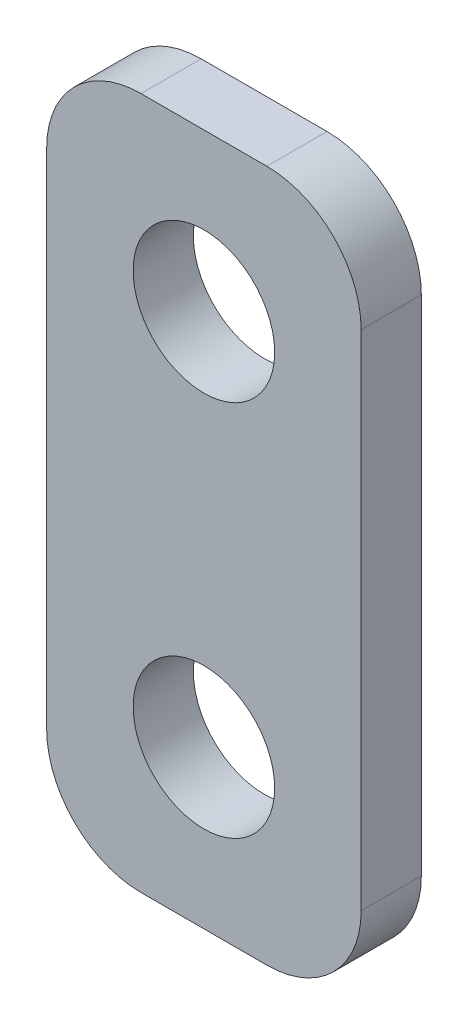
ISO-10303-21;
HEADER;
FILE_DESCRIPTION(('STEP AP214'),'2;1');
FILE_NAME('part.step','',(''),(''),'','','');
FILE_SCHEMA(('AUTOMOTIVE_DESIGN { 1 0 10303 214 1 1 1 1 }'));
ENDSEC;
DATA;
#1=APPLICATION_CONTEXT('core data for automotive mechanical design processes');
#2=APPLICATION_PROTOCOL_DEFINITION('international standard','automotive_design',2000,#1);
#3=PRODUCT_CONTEXT('',#1,'mechanical');
#4=PRODUCT('Part','Part','',(#3));
#5=PRODUCT_RELATED_PRODUCT_CATEGORY('part','',(#4));
#6=PRODUCT_DEFINITION_FORMATION('','',#4);
#7=PRODUCT_DEFINITION_CONTEXT('part definition',#1,'design');
#8=PRODUCT_DEFINITION('design','',#6,#7);
#9=PRODUCT_DEFINITION_SHAPE('','',#8);
#10=(LENGTH_UNIT() NAMED_UNIT(*) SI_UNIT(.MILLI.,.METRE.));
#11=(NAMED_UNIT(*) PLANE_ANGLE_UNIT() SI_UNIT($,.RADIAN.));
#12=(NAMED_UNIT(*) SI_UNIT($,.STERADIAN.) SOLID_ANGLE_UNIT());
#13=UNCERTAINTY_MEASURE_WITH_UNIT(LENGTH_MEASURE(1.E-05),#10,'distance_accuracy_value','');
#14=(GEOMETRIC_REPRESENTATION_CONTEXT(3) GLOBAL_UNCERTAINTY_ASSIGNED_CONTEXT((#13)) GLOBAL_UNIT_ASSIGNED_CONTEXT((#10,
#11,#12)) REPRESENTATION_CONTEXT('',''));
#15=CARTESIAN_POINT('',(0.,0.,0.));
#16=DIRECTION('',(0.,0.,1.));
#17=DIRECTION('',(1.,0.,0.));
#18=AXIS2_PLACEMENT_3D('',#15,#16,#17);
#19=CARTESIAN_POINT('',(-7.9375,17.4625,3.03784));
#20=DIRECTION('',(1.,0.,0.));
#21=DIRECTION('',(0.,1.,0.));
#22=AXIS2_PLACEMENT_3D('',#19,#20,#21);
#23=PLANE('',#22);
#24=DIRECTION('',(0.,-1.,0.));
#25=VECTOR('',#24,1.);
#26=CARTESIAN_POINT('',(-7.9375,17.4625,0.));
#27=LINE('',#26,#25);
#28=CARTESIAN_POINT('',(-7.9375,12.7,0.));
#29=VERTEX_POINT('',#28);
#30=CARTESIAN_POINT('',(-7.9375,-12.7,0.));
#31=VERTEX_POINT('',#30);
#32=EDGE_CURVE('E127',#29,#31,#27,.T.);
#33=ORIENTED_EDGE('',*,*,#32,.T.);
#34=DIRECTION('',(0.,0.,-1.));
#35=VECTOR('',#34,1.);
#36=CARTESIAN_POINT('',(-7.9375,-12.7,3.03784));
#37=LINE('',#36,#35);
#38=CARTESIAN_POINT('',(-7.9375,-12.7,3.03784));
#39=VERTEX_POINT('',#38);
#40=EDGE_CURVE('E105',#31,#39,#37,.F.);
#41=ORIENTED_EDGE('',*,*,#40,.T.);
#42=DIRECTION('',(0.,-1.,0.));
#43=VECTOR('',#42,1.);
#44=CARTESIAN_POINT('',(-7.9375,17.4625,3.03784));
#45=LINE('',#44,#43);
#46=CARTESIAN_POINT('',(-7.9375,12.7,3.03784));
#47=VERTEX_POINT('',#46);
#48=EDGE_CURVE('E137',#47,#39,#45,.T.);
#49=ORIENTED_EDGE('',*,*,#48,.F.);
#50=DIRECTION('',(0.,0.,-1.));
#51=VECTOR('',#50,1.);
#52=CARTESIAN_POINT('',(-7.9375,12.7,3.03784));
#53=LINE('',#52,#51);
#54=EDGE_CURVE('E110',#47,#29,#53,.T.);
#55=ORIENTED_EDGE('',*,*,#54,.T.);
#56=EDGE_LOOP('',(#33,#41,#49,#55));
#57=FACE_BOUND('',#56,.T.);
#58=ADVANCED_FACE('F34',(#57),#23,.F.);
#59=CARTESIAN_POINT('',(7.9375,-17.4625,3.03784));
#60=DIRECTION('',(0.,1.,0.));
#61=DIRECTION('',(0.,0.,1.));
#62=AXIS2_PLACEMENT_3D('',#59,#60,#61);
#63=PLANE('',#62);
#64=DIRECTION('',(1.,0.,0.));
#65=VECTOR('',#64,1.);
#66=CARTESIAN_POINT('',(7.9375,-17.4625,3.03784));
#67=LINE('',#66,#65);
#68=CARTESIAN_POINT('',(-3.175,-17.4625,3.03784));
#69=VERTEX_POINT('',#68);
#70=CARTESIAN_POINT('',(3.175,-17.4625,3.03784));
#71=VERTEX_POINT('',#70);
#72=EDGE_CURVE('E120',#69,#71,#67,.T.);
#73=ORIENTED_EDGE('',*,*,#72,.F.);
#74=DIRECTION('',(0.,0.,-1.));
#75=VECTOR('',#74,1.);
#76=CARTESIAN_POINT('',(-3.175,-17.4625,3.03784));
#77=LINE('',#76,#75);
#78=CARTESIAN_POINT('',(-3.175,-17.4625,0.));
#79=VERTEX_POINT('',#78);
#80=EDGE_CURVE('E104',#69,#79,#77,.T.);
#81=ORIENTED_EDGE('',*,*,#80,.T.);
#82=DIRECTION('',(1.,0.,0.));
#83=VECTOR('',#82,1.);
#84=CARTESIAN_POINT('',(7.9375,-17.4625,0.));
#85=LINE('',#84,#83);
#86=CARTESIAN_POINT('',(3.175,-17.4625,0.));
#87=VERTEX_POINT('',#86);
#88=EDGE_CURVE('E117',#79,#87,#85,.T.);
#89=ORIENTED_EDGE('',*,*,#88,.T.);
#90=DIRECTION('',(0.,0.,-1.));
#91=VECTOR('',#90,1.);
#92=CARTESIAN_POINT('',(3.175,-17.4625,3.03784));
#93=LINE('',#92,#91);
#94=EDGE_CURVE('E122',#87,#71,#93,.F.);
#95=ORIENTED_EDGE('',*,*,#94,.T.);
#96=EDGE_LOOP('',(#73,#81,#89,#95));
#97=FACE_BOUND('',#96,.T.);
#98=ADVANCED_FACE('F116',(#97),#63,.F.);
#99=CARTESIAN_POINT('',(7.9375,17.4625,3.03784));
#100=DIRECTION('',(-1.,0.,0.));
#101=DIRECTION('',(0.,-1.,0.));
#102=AXIS2_PLACEMENT_3D('',#99,#100,#101);
#103=PLANE('',#102);
#104=DIRECTION('',(0.,1.,0.));
#105=VECTOR('',#104,1.);
#106=CARTESIAN_POINT('',(7.9375,17.4625,3.03784));
#107=LINE('',#106,#105);
#108=CARTESIAN_POINT('',(7.9375,-12.7,3.03784));
#109=VERTEX_POINT('',#108);
#110=CARTESIAN_POINT('',(7.9375,12.7,3.03784));
#111=VERTEX_POINT('',#110);
#112=EDGE_CURVE('E163',#109,#111,#107,.T.);
#113=ORIENTED_EDGE('',*,*,#112,.F.);
#114=DIRECTION('',(0.,0.,-1.));
#115=VECTOR('',#114,1.);
#116=CARTESIAN_POINT('',(7.9375,-12.7,3.03784));
#117=LINE('',#116,#115);
#118=CARTESIAN_POINT('',(7.9375,-12.7,0.));
#119=VERTEX_POINT('',#118);
#120=EDGE_CURVE('E156',#109,#119,#117,.T.);
#121=ORIENTED_EDGE('',*,*,#120,.T.);
#122=DIRECTION('',(0.,1.,0.));
#123=VECTOR('',#122,1.);
#124=CARTESIAN_POINT('',(7.9375,17.4625,0.));
#125=LINE('',#124,#123);
#126=CARTESIAN_POINT('',(7.9375,12.7,0.));
#127=VERTEX_POINT('',#126);
#128=EDGE_CURVE('E126',#119,#127,#125,.T.);
#129=ORIENTED_EDGE('',*,*,#128,.T.);
#130=DIRECTION('',(0.,0.,-1.));
#131=VECTOR('',#130,1.);
#132=CARTESIAN_POINT('',(7.9375,12.7,3.03784));
#133=LINE('',#132,#131);
#134=EDGE_CURVE('E154',#127,#111,#133,.F.);
#135=ORIENTED_EDGE('',*,*,#134,.T.);
#136=EDGE_LOOP('',(#113,#121,#129,#135));
#137=FACE_BOUND('',#136,.T.);
#138=ADVANCED_FACE('F161',(#137),#103,.F.);
#139=CARTESIAN_POINT('',(7.9375,17.4625,3.03784));
#140=DIRECTION('',(0.,-1.,0.));
#141=DIRECTION('',(1.,0.,0.));
#142=AXIS2_PLACEMENT_3D('',#139,#140,#141);
#143=PLANE('',#142);
#144=DIRECTION('',(-1.,0.,0.));
#145=VECTOR('',#144,1.);
#146=CARTESIAN_POINT('',(7.9375,17.4625,3.03784));
#147=LINE('',#146,#145);
#148=CARTESIAN_POINT('',(3.175,17.4625,3.03784));
#149=VERTEX_POINT('',#148);
#150=CARTESIAN_POINT('',(-3.175,17.4625,3.03784));
#151=VERTEX_POINT('',#150);
#152=EDGE_CURVE('E138',#149,#151,#147,.T.);
#153=ORIENTED_EDGE('',*,*,#152,.F.);
#154=DIRECTION('',(0.,0.,-1.));
#155=VECTOR('',#154,1.);
#156=CARTESIAN_POINT('',(3.175,17.4625,3.03784));
#157=LINE('',#156,#155);
#158=CARTESIAN_POINT('',(3.175,17.4625,0.));
#159=VERTEX_POINT('',#158);
#160=EDGE_CURVE('E11',#149,#159,#157,.T.);
#161=ORIENTED_EDGE('',*,*,#160,.T.);
#162=DIRECTION('',(-1.,0.,0.));
#163=VECTOR('',#162,1.);
#164=CARTESIAN_POINT('',(7.9375,17.4625,0.));
#165=LINE('',#164,#163);
#166=CARTESIAN_POINT('',(-3.175,17.4625,0.));
#167=VERTEX_POINT('',#166);
#168=EDGE_CURVE('E130',#159,#167,#165,.T.);
#169=ORIENTED_EDGE('',*,*,#168,.T.);
#170=DIRECTION('',(0.,0.,-1.));
#171=VECTOR('',#170,1.);
#172=CARTESIAN_POINT('',(-3.175,17.4625,3.03784));
#173=LINE('',#172,#171);
#174=EDGE_CURVE('E42',#167,#151,#173,.F.);
#175=ORIENTED_EDGE('',*,*,#174,.T.);
#176=EDGE_LOOP('',(#153,#161,#169,#175));
#177=FACE_BOUND('',#176,.T.);
#178=ADVANCED_FACE('F170',(#177),#143,.F.);
#179=CARTESIAN_POINT('',(-7.9375,-17.4625,3.03784));
#180=DIRECTION('',(0.,0.,-1.));
#181=DIRECTION('',(-1.,0.,0.));
#182=AXIS2_PLACEMENT_3D('',#179,#180,#181);
#183=PLANE('',#182);
#184=CARTESIAN_POINT('',(0.,9.525,3.03784));
#185=DIRECTION('',(0.,0.,1.));
#186=DIRECTION('',(1.,0.,0.));
#187=AXIS2_PLACEMENT_3D('',#184,#185,#186);
#188=CIRCLE('',#187,3.57187499999999);
#189=CARTESIAN_POINT('',(3.57187499999999,9.525,3.03784));
#190=VERTEX_POINT('',#189);
#191=EDGE_CURVE('E185',#190,#190,#188,.T.);
#192=ORIENTED_EDGE('',*,*,#191,.F.);
#193=EDGE_LOOP('',(#192));
#194=FACE_BOUND('',#193,.T.);
#195=CARTESIAN_POINT('',(0.,-9.525,3.03784));
#196=DIRECTION('',(0.,0.,1.));
#197=DIRECTION('',(1.,0.,0.));
#198=AXIS2_PLACEMENT_3D('',#195,#196,#197);
#199=CIRCLE('',#198,3.57187499999999);
#200=CARTESIAN_POINT('',(3.57187499999999,-9.525,3.03784));
#201=VERTEX_POINT('',#200);
#202=EDGE_CURVE('E179',#201,#201,#199,.T.);
#203=ORIENTED_EDGE('',*,*,#202,.F.);
#204=EDGE_LOOP('',(#203));
#205=FACE_BOUND('',#204,.T.);
#206=ORIENTED_EDGE('',*,*,#48,.T.);
#207=CARTESIAN_POINT('',(-3.175,-12.7,3.03784));
#208=DIRECTION('',(0.,0.,-1.));
#209=DIRECTION('',(-1.,0.,0.));
#210=AXIS2_PLACEMENT_3D('',#207,#208,#209);
#211=CIRCLE('',#210,4.7625);
#212=EDGE_CURVE('E152',#39,#69,#211,.F.);
#213=ORIENTED_EDGE('',*,*,#212,.T.);
#214=ORIENTED_EDGE('',*,*,#72,.T.);
#215=CARTESIAN_POINT('',(3.175,-12.7,3.03784));
#216=DIRECTION('',(0.,0.,-1.));
#217=DIRECTION('',(-1.,0.,0.));
#218=AXIS2_PLACEMENT_3D('',#215,#216,#217);
#219=CIRCLE('',#218,4.7625);
#220=EDGE_CURVE('E150',#71,#109,#219,.F.);
#221=ORIENTED_EDGE('',*,*,#220,.T.);
#222=ORIENTED_EDGE('',*,*,#112,.T.);
#223=CARTESIAN_POINT('',(3.175,12.7,3.03784));
#224=DIRECTION('',(0.,0.,-1.));
#225=DIRECTION('',(-1.,0.,0.));
#226=AXIS2_PLACEMENT_3D('',#223,#224,#225);
#227=CIRCLE('',#226,4.7625);
#228=EDGE_CURVE('E55',#111,#149,#227,.F.);
#229=ORIENTED_EDGE('',*,*,#228,.T.);
#230=ORIENTED_EDGE('',*,*,#152,.T.);
#231=CARTESIAN_POINT('',(-3.175,12.7,3.03784));
#232=DIRECTION('',(0.,0.,-1.));
#233=DIRECTION('',(-1.,0.,0.));
#234=AXIS2_PLACEMENT_3D('',#231,#232,#233);
#235=CIRCLE('',#234,4.7625);
#236=EDGE_CURVE('E147',#151,#47,#235,.F.);
#237=ORIENTED_EDGE('',*,*,#236,.T.);
#238=EDGE_LOOP('',(#206,#213,#214,#221,#222,#229,#230,#237));
#239=FACE_BOUND('',#238,.T.);
#240=ADVANCED_FACE('F192',(#194,#205,#239),#183,.F.);
#241=CARTESIAN_POINT('',(-7.9375,-17.4625,0.));
#242=DIRECTION('',(0.,0.,-1.));
#243=DIRECTION('',(-1.,0.,0.));
#244=AXIS2_PLACEMENT_3D('',#241,#242,#243);
#245=PLANE('',#244);
#246=CARTESIAN_POINT('',(0.,9.525,0.));
#247=DIRECTION('',(0.,0.,-1.));
#248=DIRECTION('',(-1.,0.,0.));
#249=AXIS2_PLACEMENT_3D('',#246,#247,#248);
#250=CIRCLE('',#249,3.57187499999999);
#251=CARTESIAN_POINT('',(-3.57187499999999,9.525,0.));
#252=VERTEX_POINT('',#251);
#253=EDGE_CURVE('E182',#252,#252,#250,.T.);
#254=ORIENTED_EDGE('',*,*,#253,.F.);
#255=EDGE_LOOP('',(#254));
#256=FACE_BOUND('',#255,.T.);
#257=CARTESIAN_POINT('',(0.,-9.525,0.));
#258=DIRECTION('',(0.,0.,-1.));
#259=DIRECTION('',(-1.,0.,0.));
#260=AXIS2_PLACEMENT_3D('',#257,#258,#259);
#261=CIRCLE('',#260,3.57187499999999);
#262=CARTESIAN_POINT('',(-3.57187499999999,-9.525,0.));
#263=VERTEX_POINT('',#262);
#264=EDGE_CURVE('E132',#263,#263,#261,.T.);
#265=ORIENTED_EDGE('',*,*,#264,.F.);
#266=EDGE_LOOP('',(#265));
#267=FACE_BOUND('',#266,.T.);
#268=ORIENTED_EDGE('',*,*,#88,.F.);
#269=CARTESIAN_POINT('',(-3.175,-12.7,0.));
#270=DIRECTION('',(0.,0.,-1.));
#271=DIRECTION('',(-1.,0.,0.));
#272=AXIS2_PLACEMENT_3D('',#269,#270,#271);
#273=CIRCLE('',#272,4.7625);
#274=EDGE_CURVE('E100',#79,#31,#273,.T.);
#275=ORIENTED_EDGE('',*,*,#274,.T.);
#276=ORIENTED_EDGE('',*,*,#32,.F.);
#277=CARTESIAN_POINT('',(-3.175,12.7,0.));
#278=DIRECTION('',(0.,0.,-1.));
#279=DIRECTION('',(-1.,0.,0.));
#280=AXIS2_PLACEMENT_3D('',#277,#278,#279);
#281=CIRCLE('',#280,4.7625);
#282=EDGE_CURVE('E121',#29,#167,#281,.T.);
#283=ORIENTED_EDGE('',*,*,#282,.T.);
#284=ORIENTED_EDGE('',*,*,#168,.F.);
#285=CARTESIAN_POINT('',(3.175,12.7,0.));
#286=DIRECTION('',(0.,0.,-1.));
#287=DIRECTION('',(-1.,0.,0.));
#288=AXIS2_PLACEMENT_3D('',#285,#286,#287);
#289=CIRCLE('',#288,4.7625);
#290=EDGE_CURVE('E141',#159,#127,#289,.T.);
#291=ORIENTED_EDGE('',*,*,#290,.T.);
#292=ORIENTED_EDGE('',*,*,#128,.F.);
#293=CARTESIAN_POINT('',(3.175,-12.7,0.));
#294=DIRECTION('',(0.,0.,-1.));
#295=DIRECTION('',(-1.,0.,0.));
#296=AXIS2_PLACEMENT_3D('',#293,#294,#295);
#297=CIRCLE('',#296,4.7625);
#298=EDGE_CURVE('E111',#119,#87,#297,.T.);
#299=ORIENTED_EDGE('',*,*,#298,.T.);
#300=EDGE_LOOP('',(#268,#275,#276,#283,#284,#291,#292,#299));
#301=FACE_BOUND('',#300,.T.);
#302=ADVANCED_FACE('F124',(#256,#267,#301),#245,.T.);
#303=CARTESIAN_POINT('',(0.,-9.525,3.03784));
#304=DIRECTION('',(0.,0.,1.));
#305=DIRECTION('',(1.,0.,0.));
#306=AXIS2_PLACEMENT_3D('',#303,#304,#305);
#307=CYLINDRICAL_SURFACE('',#306,3.57187499999999);
#308=ORIENTED_EDGE('',*,*,#202,.T.);
#309=EDGE_LOOP('',(#308));
#310=FACE_BOUND('',#309,.T.);
#311=ORIENTED_EDGE('',*,*,#264,.T.);
#312=EDGE_LOOP('',(#311));
#313=FACE_BOUND('',#312,.T.);
#314=ADVANCED_FACE('F253',(#310,#313),#307,.F.);
#315=CARTESIAN_POINT('',(0.,9.525,3.03784));
#316=DIRECTION('',(0.,0.,1.));
#317=DIRECTION('',(1.,0.,0.));
#318=AXIS2_PLACEMENT_3D('',#315,#316,#317);
#319=CYLINDRICAL_SURFACE('',#318,3.57187499999999);
#320=ORIENTED_EDGE('',*,*,#191,.T.);
#321=EDGE_LOOP('',(#320));
#322=FACE_BOUND('',#321,.T.);
#323=ORIENTED_EDGE('',*,*,#253,.T.);
#324=EDGE_LOOP('',(#323));
#325=FACE_BOUND('',#324,.T.);
#326=ADVANCED_FACE('F189',(#322,#325),#319,.F.);
#327=CARTESIAN_POINT('',(-3.175,-12.7,3.03784));
#328=DIRECTION('',(0.,0.,-1.));
#329=DIRECTION('',(-1.,0.,0.));
#330=AXIS2_PLACEMENT_3D('',#327,#328,#329);
#331=CYLINDRICAL_SURFACE('',#330,4.7625);
#332=ORIENTED_EDGE('',*,*,#212,.F.);
#333=ORIENTED_EDGE('',*,*,#40,.F.);
#334=ORIENTED_EDGE('',*,*,#274,.F.);
#335=ORIENTED_EDGE('',*,*,#80,.F.);
#336=EDGE_LOOP('',(#332,#333,#334,#335));
#337=FACE_BOUND('',#336,.T.);
#338=ADVANCED_FACE('F103',(#337),#331,.T.);
#339=CARTESIAN_POINT('',(3.175,-12.7,3.03784));
#340=DIRECTION('',(0.,0.,-1.));
#341=DIRECTION('',(-1.,0.,0.));
#342=AXIS2_PLACEMENT_3D('',#339,#340,#341);
#343=CYLINDRICAL_SURFACE('',#342,4.7625);
#344=ORIENTED_EDGE('',*,*,#220,.F.);
#345=ORIENTED_EDGE('',*,*,#94,.F.);
#346=ORIENTED_EDGE('',*,*,#298,.F.);
#347=ORIENTED_EDGE('',*,*,#120,.F.);
#348=EDGE_LOOP('',(#344,#345,#346,#347));
#349=FACE_BOUND('',#348,.T.);
#350=ADVANCED_FACE('F205',(#349),#343,.T.);
#351=CARTESIAN_POINT('',(3.175,12.7,3.03784));
#352=DIRECTION('',(0.,0.,-1.));
#353=DIRECTION('',(-1.,0.,0.));
#354=AXIS2_PLACEMENT_3D('',#351,#352,#353);
#355=CYLINDRICAL_SURFACE('',#354,4.7625);
#356=ORIENTED_EDGE('',*,*,#228,.F.);
#357=ORIENTED_EDGE('',*,*,#134,.F.);
#358=ORIENTED_EDGE('',*,*,#290,.F.);
#359=ORIENTED_EDGE('',*,*,#160,.F.);
#360=EDGE_LOOP('',(#356,#357,#358,#359));
#361=FACE_BOUND('',#360,.T.);
#362=ADVANCED_FACE('F169',(#361),#355,.T.);
#363=CARTESIAN_POINT('',(-3.175,12.7,3.03784));
#364=DIRECTION('',(0.,0.,-1.));
#365=DIRECTION('',(-1.,0.,0.));
#366=AXIS2_PLACEMENT_3D('',#363,#364,#365);
#367=CYLINDRICAL_SURFACE('',#366,4.7625);
#368=ORIENTED_EDGE('',*,*,#236,.F.);
#369=ORIENTED_EDGE('',*,*,#174,.F.);
#370=ORIENTED_EDGE('',*,*,#282,.F.);
#371=ORIENTED_EDGE('',*,*,#54,.F.);
#372=EDGE_LOOP('',(#368,#369,#370,#371));
#373=FACE_BOUND('',#372,.T.);
#374=ADVANCED_FACE('F36',(#373),#367,.T.);
#375=CLOSED_SHELL('',(#58,#98,#138,#178,#240,#302,#314,#326,#338,#350,#362,#374));
#376=MANIFOLD_SOLID_BREP('B2',#375);
#377=ADVANCED_BREP_SHAPE_REPRESENTATION('',(#18,#376),#14);
#378=SHAPE_DEFINITION_REPRESENTATION(#9,#377);
ENDSEC;
END-ISO-10303-21;
